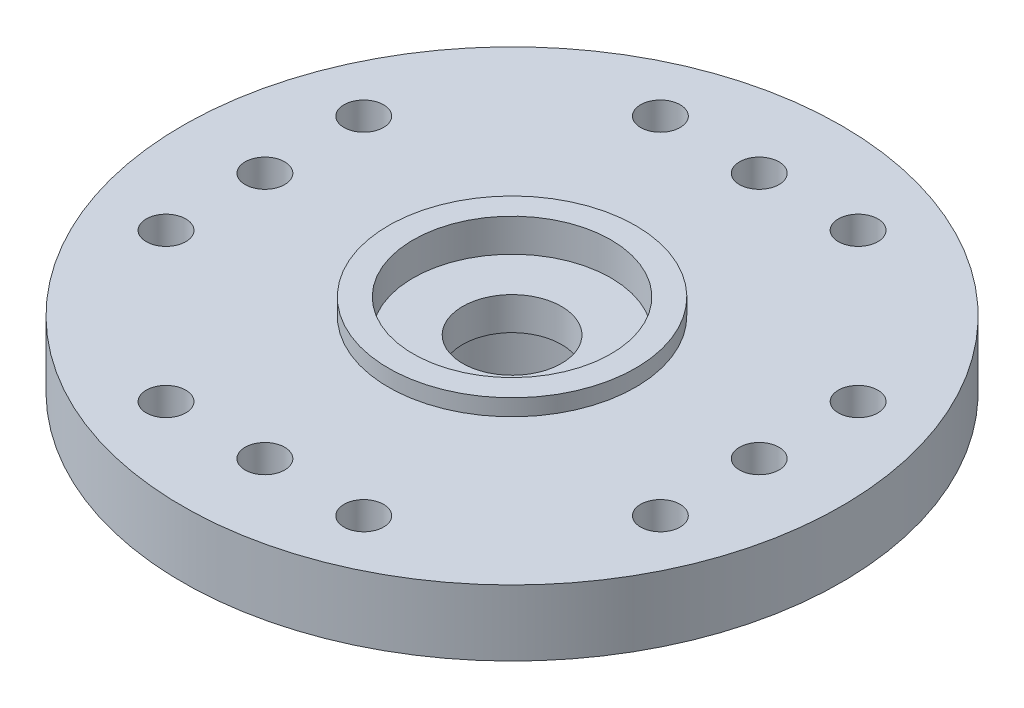
ISO-10303-21;
HEADER;
FILE_DESCRIPTION(('STEP AP214'),'2;1');
FILE_NAME('part.step','',(''),(''),'','','');
FILE_SCHEMA(('AUTOMOTIVE_DESIGN { 1 0 10303 214 1 1 1 1 }'));
ENDSEC;
DATA;
#1=APPLICATION_CONTEXT('core data for automotive mechanical design processes');
#2=APPLICATION_PROTOCOL_DEFINITION('international standard','automotive_design',2000,#1);
#3=PRODUCT_CONTEXT('',#1,'mechanical');
#4=PRODUCT('Part','Part','',(#3));
#5=PRODUCT_RELATED_PRODUCT_CATEGORY('part','',(#4));
#6=PRODUCT_DEFINITION_FORMATION('','',#4);
#7=PRODUCT_DEFINITION_CONTEXT('part definition',#1,'design');
#8=PRODUCT_DEFINITION('design','',#6,#7);
#9=PRODUCT_DEFINITION_SHAPE('','',#8);
#10=(LENGTH_UNIT() NAMED_UNIT(*) SI_UNIT(.MILLI.,.METRE.));
#11=(NAMED_UNIT(*) PLANE_ANGLE_UNIT() SI_UNIT($,.RADIAN.));
#12=(NAMED_UNIT(*) SI_UNIT($,.STERADIAN.) SOLID_ANGLE_UNIT());
#13=UNCERTAINTY_MEASURE_WITH_UNIT(LENGTH_MEASURE(1.E-05),#10,'distance_accuracy_value','');
#14=(GEOMETRIC_REPRESENTATION_CONTEXT(3) GLOBAL_UNCERTAINTY_ASSIGNED_CONTEXT((#13)) GLOBAL_UNIT_ASSIGNED_CONTEXT((#10,
#11,#12)) REPRESENTATION_CONTEXT('',''));
#15=CARTESIAN_POINT('',(0.,0.,0.));
#16=DIRECTION('',(0.,0.,1.));
#17=DIRECTION('',(1.,0.,0.));
#18=AXIS2_PLACEMENT_3D('',#15,#16,#17);
#19=CARTESIAN_POINT('',(4.5,0.,0.));
#20=DIRECTION('',(0.,-1.,0.));
#21=DIRECTION('',(0.,0.,-1.));
#22=AXIS2_PLACEMENT_3D('',#19,#20,#21);
#23=PLANE('',#22);
#24=CARTESIAN_POINT('',(0.,0.,0.));
#25=DIRECTION('',(0.,-1.,0.));
#26=DIRECTION('',(0.,0.,-1.));
#27=AXIS2_PLACEMENT_3D('',#24,#25,#26);
#28=CIRCLE('',#27,4.5);
#29=CARTESIAN_POINT('',(0.,0.,-4.5));
#30=VERTEX_POINT('',#29);
#31=EDGE_CURVE('E70',#30,#30,#28,.T.);
#32=ORIENTED_EDGE('',*,*,#31,.T.);
#33=EDGE_LOOP('',(#32));
#34=FACE_BOUND('',#33,.T.);
#35=CARTESIAN_POINT('',(0.,0.,0.));
#36=DIRECTION('',(0.,-1.,0.));
#37=DIRECTION('',(0.,0.,-1.));
#38=AXIS2_PLACEMENT_3D('',#35,#36,#37);
#39=CIRCLE('',#38,2.75);
#40=CARTESIAN_POINT('',(0.,0.,-2.75));
#41=VERTEX_POINT('',#40);
#42=EDGE_CURVE('E10',#41,#41,#39,.T.);
#43=ORIENTED_EDGE('',*,*,#42,.F.);
#44=EDGE_LOOP('',(#43));
#45=FACE_BOUND('',#44,.T.);
#46=ADVANCED_FACE('F30',(#34,#45),#23,.T.);
#47=CARTESIAN_POINT('',(0.,0.,0.));
#48=DIRECTION('',(0.,-1.,0.));
#49=DIRECTION('',(0.,0.,-1.));
#50=AXIS2_PLACEMENT_3D('',#47,#48,#49);
#51=CYLINDRICAL_SURFACE('',#50,2.75);
#52=ORIENTED_EDGE('',*,*,#42,.T.);
#53=EDGE_LOOP('',(#52));
#54=FACE_BOUND('',#53,.T.);
#55=CARTESIAN_POINT('',(0.,3.,0.));
#56=DIRECTION('',(0.,-1.,0.));
#57=DIRECTION('',(0.,0.,-1.));
#58=AXIS2_PLACEMENT_3D('',#55,#56,#57);
#59=CIRCLE('',#58,2.75);
#60=CARTESIAN_POINT('',(0.,3.,-2.75));
#61=VERTEX_POINT('',#60);
#62=EDGE_CURVE('E36',#61,#61,#59,.T.);
#63=ORIENTED_EDGE('',*,*,#62,.F.);
#64=EDGE_LOOP('',(#63));
#65=FACE_BOUND('',#64,.T.);
#66=ADVANCED_FACE('F193',(#54,#65),#51,.F.);
#67=CARTESIAN_POINT('',(2.75,3.,0.));
#68=DIRECTION('',(0.,-1.,0.));
#69=DIRECTION('',(0.,0.,-1.));
#70=AXIS2_PLACEMENT_3D('',#67,#68,#69);
#71=PLANE('',#70);
#72=ORIENTED_EDGE('',*,*,#62,.T.);
#73=EDGE_LOOP('',(#72));
#74=FACE_BOUND('',#73,.T.);
#75=CARTESIAN_POINT('',(0.,3.,0.));
#76=DIRECTION('',(0.,-1.,0.));
#77=DIRECTION('',(0.,0.,-1.));
#78=AXIS2_PLACEMENT_3D('',#75,#76,#77);
#79=CIRCLE('',#78,1.5);
#80=CARTESIAN_POINT('',(0.,3.,-1.5));
#81=VERTEX_POINT('',#80);
#82=EDGE_CURVE('E40',#81,#81,#79,.T.);
#83=ORIENTED_EDGE('',*,*,#82,.F.);
#84=EDGE_LOOP('',(#83));
#85=FACE_BOUND('',#84,.T.);
#86=ADVANCED_FACE('F197',(#74,#85),#71,.T.);
#87=CARTESIAN_POINT('',(0.,0.,0.));
#88=DIRECTION('',(0.,-1.,0.));
#89=DIRECTION('',(0.,0.,-1.));
#90=AXIS2_PLACEMENT_3D('',#87,#88,#89);
#91=CYLINDRICAL_SURFACE('',#90,1.5);
#92=ORIENTED_EDGE('',*,*,#82,.T.);
#93=EDGE_LOOP('',(#92));
#94=FACE_BOUND('',#93,.T.);
#95=CARTESIAN_POINT('',(0.,4.,0.));
#96=DIRECTION('',(0.,-1.,0.));
#97=DIRECTION('',(0.,0.,-1.));
#98=AXIS2_PLACEMENT_3D('',#95,#96,#97);
#99=CIRCLE('',#98,1.5);
#100=CARTESIAN_POINT('',(0.,4.,-1.5));
#101=VERTEX_POINT('',#100);
#102=EDGE_CURVE('E44',#101,#101,#99,.T.);
#103=ORIENTED_EDGE('',*,*,#102,.F.);
#104=EDGE_LOOP('',(#103));
#105=FACE_BOUND('',#104,.T.);
#106=ADVANCED_FACE('F201',(#94,#105),#91,.F.);
#107=CARTESIAN_POINT('',(1.5,4.,0.));
#108=DIRECTION('',(0.,1.,0.));
#109=DIRECTION('',(0.,0.,1.));
#110=AXIS2_PLACEMENT_3D('',#107,#108,#109);
#111=PLANE('',#110);
#112=ORIENTED_EDGE('',*,*,#102,.T.);
#113=EDGE_LOOP('',(#112));
#114=FACE_BOUND('',#113,.T.);
#115=CARTESIAN_POINT('',(0.,4.,0.));
#116=DIRECTION('',(0.,-1.,0.));
#117=DIRECTION('',(0.,0.,-1.));
#118=AXIS2_PLACEMENT_3D('',#115,#116,#117);
#119=CIRCLE('',#118,3.);
#120=CARTESIAN_POINT('',(0.,4.,-3.));
#121=VERTEX_POINT('',#120);
#122=EDGE_CURVE('E49',#121,#121,#119,.T.);
#123=ORIENTED_EDGE('',*,*,#122,.F.);
#124=EDGE_LOOP('',(#123));
#125=FACE_BOUND('',#124,.T.);
#126=ADVANCED_FACE('F207',(#114,#125),#111,.T.);
#127=CARTESIAN_POINT('',(0.,0.,0.));
#128=DIRECTION('',(0.,-1.,0.));
#129=DIRECTION('',(0.,0.,-1.));
#130=AXIS2_PLACEMENT_3D('',#127,#128,#129);
#131=CYLINDRICAL_SURFACE('',#130,3.);
#132=ORIENTED_EDGE('',*,*,#122,.T.);
#133=EDGE_LOOP('',(#132));
#134=FACE_BOUND('',#133,.T.);
#135=CARTESIAN_POINT('',(0.,5.,0.));
#136=DIRECTION('',(0.,-1.,0.));
#137=DIRECTION('',(0.,0.,-1.));
#138=AXIS2_PLACEMENT_3D('',#135,#136,#137);
#139=CIRCLE('',#138,3.);
#140=CARTESIAN_POINT('',(0.,5.,-3.));
#141=VERTEX_POINT('',#140);
#142=EDGE_CURVE('E52',#141,#141,#139,.T.);
#143=ORIENTED_EDGE('',*,*,#142,.F.);
#144=EDGE_LOOP('',(#143));
#145=FACE_BOUND('',#144,.T.);
#146=ADVANCED_FACE('F211',(#134,#145),#131,.F.);
#147=CARTESIAN_POINT('',(3.,5.,0.));
#148=DIRECTION('',(0.,1.,0.));
#149=DIRECTION('',(0.,0.,1.));
#150=AXIS2_PLACEMENT_3D('',#147,#148,#149);
#151=PLANE('',#150);
#152=ORIENTED_EDGE('',*,*,#142,.T.);
#153=EDGE_LOOP('',(#152));
#154=FACE_BOUND('',#153,.T.);
#155=CARTESIAN_POINT('',(0.,5.,0.));
#156=DIRECTION('',(0.,-1.,0.));
#157=DIRECTION('',(0.,0.,-1.));
#158=AXIS2_PLACEMENT_3D('',#155,#156,#157);
#159=CIRCLE('',#158,3.75);
#160=CARTESIAN_POINT('',(0.,5.,-3.75));
#161=VERTEX_POINT('',#160);
#162=EDGE_CURVE('E55',#161,#161,#159,.T.);
#163=ORIENTED_EDGE('',*,*,#162,.F.);
#164=EDGE_LOOP('',(#163));
#165=FACE_BOUND('',#164,.T.);
#166=ADVANCED_FACE('F215',(#154,#165),#151,.T.);
#167=CARTESIAN_POINT('',(0.,0.,0.));
#168=DIRECTION('',(0.,-1.,0.));
#169=DIRECTION('',(0.,0.,-1.));
#170=AXIS2_PLACEMENT_3D('',#167,#168,#169);
#171=CYLINDRICAL_SURFACE('',#170,3.75);
#172=ORIENTED_EDGE('',*,*,#162,.T.);
#173=EDGE_LOOP('',(#172));
#174=FACE_BOUND('',#173,.T.);
#175=CARTESIAN_POINT('',(0.,4.5,0.));
#176=DIRECTION('',(0.,-1.,0.));
#177=DIRECTION('',(0.,0.,-1.));
#178=AXIS2_PLACEMENT_3D('',#175,#176,#177);
#179=CIRCLE('',#178,3.75);
#180=CARTESIAN_POINT('',(0.,4.5,-3.75));
#181=VERTEX_POINT('',#180);
#182=EDGE_CURVE('E58',#181,#181,#179,.T.);
#183=ORIENTED_EDGE('',*,*,#182,.F.);
#184=EDGE_LOOP('',(#183));
#185=FACE_BOUND('',#184,.T.);
#186=ADVANCED_FACE('F153',(#174,#185),#171,.T.);
#187=CARTESIAN_POINT('',(3.75,4.5,0.));
#188=DIRECTION('',(0.,1.,0.));
#189=DIRECTION('',(0.,0.,1.));
#190=AXIS2_PLACEMENT_3D('',#187,#188,#189);
#191=PLANE('',#190);
#192=CARTESIAN_POINT('',(7.49999999999999,4.5,3.00000000000003));
#193=DIRECTION('',(0.,1.,0.));
#194=DIRECTION('',(-1.,0.,0.));
#195=AXIS2_PLACEMENT_3D('',#192,#193,#194);
#196=CIRCLE('',#195,0.6);
#197=CARTESIAN_POINT('',(6.89999999999999,4.5,3.00000000000002));
#198=VERTEX_POINT('',#197);
#199=EDGE_CURVE('E115',#198,#198,#196,.T.);
#200=ORIENTED_EDGE('',*,*,#199,.F.);
#201=EDGE_LOOP('',(#200));
#202=FACE_BOUND('',#201,.T.);
#203=CARTESIAN_POINT('',(7.50000000000001,4.5,-2.99999999999997));
#204=DIRECTION('',(0.,1.,0.));
#205=DIRECTION('',(1.,0.,0.));
#206=AXIS2_PLACEMENT_3D('',#203,#204,#205);
#207=CIRCLE('',#206,0.6);
#208=CARTESIAN_POINT('',(8.10000000000001,4.5,-2.99999999999997));
#209=VERTEX_POINT('',#208);
#210=EDGE_CURVE('E109',#209,#209,#207,.T.);
#211=ORIENTED_EDGE('',*,*,#210,.F.);
#212=EDGE_LOOP('',(#211));
#213=FACE_BOUND('',#212,.T.);
#214=CARTESIAN_POINT('',(0.,4.5,7.5));
#215=DIRECTION('',(0.,1.,0.));
#216=DIRECTION('',(0.,0.,-1.));
#217=AXIS2_PLACEMENT_3D('',#214,#215,#216);
#218=CIRCLE('',#217,0.6);
#219=CARTESIAN_POINT('',(0.,4.5,6.9));
#220=VERTEX_POINT('',#219);
#221=EDGE_CURVE('E101',#220,#220,#218,.T.);
#222=ORIENTED_EDGE('',*,*,#221,.F.);
#223=EDGE_LOOP('',(#222));
#224=FACE_BOUND('',#223,.T.);
#225=CARTESIAN_POINT('',(-3.,4.5,7.5));
#226=DIRECTION('',(0.,1.,0.));
#227=DIRECTION('',(0.,0.,-1.));
#228=AXIS2_PLACEMENT_3D('',#225,#226,#227);
#229=CIRCLE('',#228,0.6);
#230=CARTESIAN_POINT('',(-3.,4.5,6.9));
#231=VERTEX_POINT('',#230);
#232=EDGE_CURVE('E102',#231,#231,#229,.T.);
#233=ORIENTED_EDGE('',*,*,#232,.F.);
#234=EDGE_LOOP('',(#233));
#235=FACE_BOUND('',#234,.T.);
#236=CARTESIAN_POINT('',(-7.50000000000003,4.5,2.99999999999992));
#237=DIRECTION('',(0.,1.,0.));
#238=DIRECTION('',(-1.,0.,0.));
#239=AXIS2_PLACEMENT_3D('',#236,#237,#238);
#240=CIRCLE('',#239,0.6);
#241=CARTESIAN_POINT('',(-8.10000000000003,4.5,2.99999999999992));
#242=VERTEX_POINT('',#241);
#243=EDGE_CURVE('E138',#242,#242,#240,.T.);
#244=ORIENTED_EDGE('',*,*,#243,.F.);
#245=EDGE_LOOP('',(#244));
#246=FACE_BOUND('',#245,.T.);
#247=CARTESIAN_POINT('',(-7.49999999999997,4.5,-3.00000000000008));
#248=DIRECTION('',(0.,1.,0.));
#249=DIRECTION('',(1.,0.,0.));
#250=AXIS2_PLACEMENT_3D('',#247,#248,#249);
#251=CIRCLE('',#250,0.6);
#252=CARTESIAN_POINT('',(-6.89999999999997,4.5,-3.00000000000007));
#253=VERTEX_POINT('',#252);
#254=EDGE_CURVE('E137',#253,#253,#251,.T.);
#255=ORIENTED_EDGE('',*,*,#254,.F.);
#256=EDGE_LOOP('',(#255));
#257=FACE_BOUND('',#256,.T.);
#258=CARTESIAN_POINT('',(-7.5,4.5,0.));
#259=DIRECTION('',(0.,1.,0.));
#260=DIRECTION('',(1.,0.,0.));
#261=AXIS2_PLACEMENT_3D('',#258,#259,#260);
#262=CIRCLE('',#261,0.6);
#263=CARTESIAN_POINT('',(-6.9,4.5,0.));
#264=VERTEX_POINT('',#263);
#265=EDGE_CURVE('E126',#264,#264,#262,.T.);
#266=ORIENTED_EDGE('',*,*,#265,.F.);
#267=EDGE_LOOP('',(#266));
#268=FACE_BOUND('',#267,.T.);
#269=CARTESIAN_POINT('',(3.,4.5,7.5));
#270=DIRECTION('',(0.,1.,0.));
#271=DIRECTION('',(0.,0.,1.));
#272=AXIS2_PLACEMENT_3D('',#269,#270,#271);
#273=CIRCLE('',#272,0.6);
#274=CARTESIAN_POINT('',(3.,4.5,8.1));
#275=VERTEX_POINT('',#274);
#276=EDGE_CURVE('E125',#275,#275,#273,.T.);
#277=ORIENTED_EDGE('',*,*,#276,.F.);
#278=EDGE_LOOP('',(#277));
#279=FACE_BOUND('',#278,.T.);
#280=CARTESIAN_POINT('',(7.5,4.5,0.));
#281=DIRECTION('',(0.,1.,0.));
#282=DIRECTION('',(-1.,0.,0.));
#283=AXIS2_PLACEMENT_3D('',#280,#281,#282);
#284=CIRCLE('',#283,0.6);
#285=CARTESIAN_POINT('',(6.9,4.5,0.));
#286=VERTEX_POINT('',#285);
#287=EDGE_CURVE('E94',#286,#286,#284,.T.);
#288=ORIENTED_EDGE('',*,*,#287,.F.);
#289=EDGE_LOOP('',(#288));
#290=FACE_BOUND('',#289,.T.);
#291=CARTESIAN_POINT('',(-3.,4.5,-7.5));
#292=DIRECTION('',(0.,1.,0.));
#293=DIRECTION('',(0.,0.,-1.));
#294=AXIS2_PLACEMENT_3D('',#291,#292,#293);
#295=CIRCLE('',#294,0.6);
#296=CARTESIAN_POINT('',(-3.,4.5,-8.1));
#297=VERTEX_POINT('',#296);
#298=EDGE_CURVE('E84',#297,#297,#295,.T.);
#299=ORIENTED_EDGE('',*,*,#298,.F.);
#300=EDGE_LOOP('',(#299));
#301=FACE_BOUND('',#300,.T.);
#302=CARTESIAN_POINT('',(3.,4.5,-7.5));
#303=DIRECTION('',(0.,1.,0.));
#304=DIRECTION('',(0.,0.,1.));
#305=AXIS2_PLACEMENT_3D('',#302,#303,#304);
#306=CIRCLE('',#305,0.6);
#307=CARTESIAN_POINT('',(3.,4.5,-6.9));
#308=VERTEX_POINT('',#307);
#309=EDGE_CURVE('E83',#308,#308,#306,.T.);
#310=ORIENTED_EDGE('',*,*,#309,.F.);
#311=EDGE_LOOP('',(#310));
#312=FACE_BOUND('',#311,.T.);
#313=CARTESIAN_POINT('',(0.,4.5,-7.5));
#314=DIRECTION('',(0.,1.,0.));
#315=DIRECTION('',(0.,0.,1.));
#316=AXIS2_PLACEMENT_3D('',#313,#314,#315);
#317=CIRCLE('',#316,0.6);
#318=CARTESIAN_POINT('',(0.,4.5,-6.9));
#319=VERTEX_POINT('',#318);
#320=EDGE_CURVE('E76',#319,#319,#317,.T.);
#321=ORIENTED_EDGE('',*,*,#320,.F.);
#322=EDGE_LOOP('',(#321));
#323=FACE_BOUND('',#322,.T.);
#324=ORIENTED_EDGE('',*,*,#182,.T.);
#325=EDGE_LOOP('',(#324));
#326=FACE_BOUND('',#325,.T.);
#327=CARTESIAN_POINT('',(0.,4.5,0.));
#328=DIRECTION('',(0.,-1.,0.));
#329=DIRECTION('',(0.,0.,-1.));
#330=AXIS2_PLACEMENT_3D('',#327,#328,#329);
#331=CIRCLE('',#330,10.);
#332=CARTESIAN_POINT('',(0.,4.5,-10.));
#333=VERTEX_POINT('',#332);
#334=EDGE_CURVE('E61',#333,#333,#331,.T.);
#335=ORIENTED_EDGE('',*,*,#334,.F.);
#336=EDGE_LOOP('',(#335));
#337=FACE_BOUND('',#336,.T.);
#338=ADVANCED_FACE('F149',(#202,#213,#224,#235,#246,#257,#268,#279,#290,#301,#312,#323,#326,
#337),#191,.T.);
#339=CARTESIAN_POINT('',(0.,0.,0.));
#340=DIRECTION('',(0.,-1.,0.));
#341=DIRECTION('',(0.,0.,-1.));
#342=AXIS2_PLACEMENT_3D('',#339,#340,#341);
#343=CYLINDRICAL_SURFACE('',#342,10.);
#344=ORIENTED_EDGE('',*,*,#334,.T.);
#345=EDGE_LOOP('',(#344));
#346=FACE_BOUND('',#345,.T.);
#347=CARTESIAN_POINT('',(0.,2.5,0.));
#348=DIRECTION('',(0.,-1.,0.));
#349=DIRECTION('',(0.,0.,-1.));
#350=AXIS2_PLACEMENT_3D('',#347,#348,#349);
#351=CIRCLE('',#350,10.);
#352=CARTESIAN_POINT('',(0.,2.5,-10.));
#353=VERTEX_POINT('',#352);
#354=EDGE_CURVE('E64',#353,#353,#351,.T.);
#355=ORIENTED_EDGE('',*,*,#354,.F.);
#356=EDGE_LOOP('',(#355));
#357=FACE_BOUND('',#356,.T.);
#358=ADVANCED_FACE('F152',(#346,#357),#343,.T.);
#359=CARTESIAN_POINT('',(10.,2.5,0.));
#360=DIRECTION('',(0.,-1.,0.));
#361=DIRECTION('',(0.,0.,-1.));
#362=AXIS2_PLACEMENT_3D('',#359,#360,#361);
#363=PLANE('',#362);
#364=CARTESIAN_POINT('',(7.49999999999999,2.5,3.00000000000003));
#365=DIRECTION('',(0.,-1.,0.));
#366=DIRECTION('',(0.,0.,-1.));
#367=AXIS2_PLACEMENT_3D('',#364,#365,#366);
#368=CIRCLE('',#367,0.6);
#369=CARTESIAN_POINT('',(7.49999999999999,2.5,2.40000000000003));
#370=VERTEX_POINT('',#369);
#371=EDGE_CURVE('E97',#370,#370,#368,.F.);
#372=ORIENTED_EDGE('',*,*,#371,.T.);
#373=EDGE_LOOP('',(#372));
#374=FACE_BOUND('',#373,.T.);
#375=CARTESIAN_POINT('',(7.50000000000001,2.5,-2.99999999999997));
#376=DIRECTION('',(0.,-1.,0.));
#377=DIRECTION('',(0.,0.,-1.));
#378=AXIS2_PLACEMENT_3D('',#375,#376,#377);
#379=CIRCLE('',#378,0.6);
#380=CARTESIAN_POINT('',(7.50000000000001,2.5,-3.59999999999997));
#381=VERTEX_POINT('',#380);
#382=EDGE_CURVE('E112',#381,#381,#379,.F.);
#383=ORIENTED_EDGE('',*,*,#382,.T.);
#384=EDGE_LOOP('',(#383));
#385=FACE_BOUND('',#384,.T.);
#386=CARTESIAN_POINT('',(0.,2.5,7.5));
#387=DIRECTION('',(0.,-1.,0.));
#388=DIRECTION('',(0.,0.,-1.));
#389=AXIS2_PLACEMENT_3D('',#386,#387,#388);
#390=CIRCLE('',#389,0.6);
#391=CARTESIAN_POINT('',(0.,2.5,6.9));
#392=VERTEX_POINT('',#391);
#393=EDGE_CURVE('E106',#392,#392,#390,.F.);
#394=ORIENTED_EDGE('',*,*,#393,.T.);
#395=EDGE_LOOP('',(#394));
#396=FACE_BOUND('',#395,.T.);
#397=CARTESIAN_POINT('',(-3.,2.5,7.5));
#398=DIRECTION('',(0.,-1.,0.));
#399=DIRECTION('',(0.,0.,-1.));
#400=AXIS2_PLACEMENT_3D('',#397,#398,#399);
#401=CIRCLE('',#400,0.6);
#402=CARTESIAN_POINT('',(-3.,2.5,6.9));
#403=VERTEX_POINT('',#402);
#404=EDGE_CURVE('E98',#403,#403,#401,.F.);
#405=ORIENTED_EDGE('',*,*,#404,.T.);
#406=EDGE_LOOP('',(#405));
#407=FACE_BOUND('',#406,.T.);
#408=CARTESIAN_POINT('',(-7.50000000000003,2.5,2.99999999999992));
#409=DIRECTION('',(0.,-1.,0.));
#410=DIRECTION('',(0.,0.,-1.));
#411=AXIS2_PLACEMENT_3D('',#408,#409,#410);
#412=CIRCLE('',#411,0.6);
#413=CARTESIAN_POINT('',(-7.50000000000003,2.5,2.39999999999992));
#414=VERTEX_POINT('',#413);
#415=EDGE_CURVE('E134',#414,#414,#412,.F.);
#416=ORIENTED_EDGE('',*,*,#415,.T.);
#417=EDGE_LOOP('',(#416));
#418=FACE_BOUND('',#417,.T.);
#419=CARTESIAN_POINT('',(-7.49999999999997,2.5,-3.00000000000008));
#420=DIRECTION('',(0.,-1.,0.));
#421=DIRECTION('',(0.,0.,-1.));
#422=AXIS2_PLACEMENT_3D('',#419,#420,#421);
#423=CIRCLE('',#422,0.6);
#424=CARTESIAN_POINT('',(-7.49999999999997,2.5,-3.60000000000008));
#425=VERTEX_POINT('',#424);
#426=EDGE_CURVE('E129',#425,#425,#423,.F.);
#427=ORIENTED_EDGE('',*,*,#426,.T.);
#428=EDGE_LOOP('',(#427));
#429=FACE_BOUND('',#428,.T.);
#430=CARTESIAN_POINT('',(-7.5,2.5,0.));
#431=DIRECTION('',(0.,-1.,0.));
#432=DIRECTION('',(0.,0.,-1.));
#433=AXIS2_PLACEMENT_3D('',#430,#431,#432);
#434=CIRCLE('',#433,0.6);
#435=CARTESIAN_POINT('',(-7.5,2.5,-0.600000000000079));
#436=VERTEX_POINT('',#435);
#437=EDGE_CURVE('E122',#436,#436,#434,.F.);
#438=ORIENTED_EDGE('',*,*,#437,.T.);
#439=EDGE_LOOP('',(#438));
#440=FACE_BOUND('',#439,.T.);
#441=CARTESIAN_POINT('',(3.,2.5,7.5));
#442=DIRECTION('',(0.,-1.,0.));
#443=DIRECTION('',(0.,0.,-1.));
#444=AXIS2_PLACEMENT_3D('',#441,#442,#443);
#445=CIRCLE('',#444,0.6);
#446=CARTESIAN_POINT('',(3.,2.5,6.9));
#447=VERTEX_POINT('',#446);
#448=EDGE_CURVE('E105',#447,#447,#445,.F.);
#449=ORIENTED_EDGE('',*,*,#448,.T.);
#450=EDGE_LOOP('',(#449));
#451=FACE_BOUND('',#450,.T.);
#452=CARTESIAN_POINT('',(7.5,2.5,0.));
#453=DIRECTION('',(0.,-1.,0.));
#454=DIRECTION('',(0.,0.,-1.));
#455=AXIS2_PLACEMENT_3D('',#452,#453,#454);
#456=CIRCLE('',#455,0.6);
#457=CARTESIAN_POINT('',(7.5,2.5,-0.599999999999973));
#458=VERTEX_POINT('',#457);
#459=EDGE_CURVE('E87',#458,#458,#456,.F.);
#460=ORIENTED_EDGE('',*,*,#459,.T.);
#461=EDGE_LOOP('',(#460));
#462=FACE_BOUND('',#461,.T.);
#463=CARTESIAN_POINT('',(-3.,2.5,-7.5));
#464=DIRECTION('',(0.,-1.,0.));
#465=DIRECTION('',(0.,0.,-1.));
#466=AXIS2_PLACEMENT_3D('',#463,#464,#465);
#467=CIRCLE('',#466,0.6);
#468=CARTESIAN_POINT('',(-3.,2.5,-8.1));
#469=VERTEX_POINT('',#468);
#470=EDGE_CURVE('E80',#469,#469,#467,.F.);
#471=ORIENTED_EDGE('',*,*,#470,.T.);
#472=EDGE_LOOP('',(#471));
#473=FACE_BOUND('',#472,.T.);
#474=CARTESIAN_POINT('',(3.,2.5,-7.5));
#475=DIRECTION('',(0.,-1.,0.));
#476=DIRECTION('',(0.,0.,-1.));
#477=AXIS2_PLACEMENT_3D('',#474,#475,#476);
#478=CIRCLE('',#477,0.6);
#479=CARTESIAN_POINT('',(3.,2.5,-8.1));
#480=VERTEX_POINT('',#479);
#481=EDGE_CURVE('E79',#480,#480,#478,.F.);
#482=ORIENTED_EDGE('',*,*,#481,.T.);
#483=EDGE_LOOP('',(#482));
#484=FACE_BOUND('',#483,.T.);
#485=CARTESIAN_POINT('',(0.,2.5,-7.5));
#486=DIRECTION('',(0.,-1.,0.));
#487=DIRECTION('',(0.,0.,-1.));
#488=AXIS2_PLACEMENT_3D('',#485,#486,#487);
#489=CIRCLE('',#488,0.6);
#490=CARTESIAN_POINT('',(0.,2.5,-8.1));
#491=VERTEX_POINT('',#490);
#492=EDGE_CURVE('E73',#491,#491,#489,.F.);
#493=ORIENTED_EDGE('',*,*,#492,.T.);
#494=EDGE_LOOP('',(#493));
#495=FACE_BOUND('',#494,.T.);
#496=ORIENTED_EDGE('',*,*,#354,.T.);
#497=EDGE_LOOP('',(#496));
#498=FACE_BOUND('',#497,.T.);
#499=CARTESIAN_POINT('',(0.,2.5,0.));
#500=DIRECTION('',(0.,-1.,0.));
#501=DIRECTION('',(0.,0.,-1.));
#502=AXIS2_PLACEMENT_3D('',#499,#500,#501);
#503=CIRCLE('',#502,4.5);
#504=CARTESIAN_POINT('',(0.,2.5,-4.5));
#505=VERTEX_POINT('',#504);
#506=EDGE_CURVE('E67',#505,#505,#503,.T.);
#507=ORIENTED_EDGE('',*,*,#506,.F.);
#508=EDGE_LOOP('',(#507));
#509=FACE_BOUND('',#508,.T.);
#510=ADVANCED_FACE('F174',(#374,#385,#396,#407,#418,#429,#440,#451,#462,#473,#484,#495,#498,
#509),#363,.T.);
#511=CARTESIAN_POINT('',(0.,0.,0.));
#512=DIRECTION('',(0.,-1.,0.));
#513=DIRECTION('',(0.,0.,-1.));
#514=AXIS2_PLACEMENT_3D('',#511,#512,#513);
#515=CYLINDRICAL_SURFACE('',#514,4.5);
#516=ORIENTED_EDGE('',*,*,#506,.T.);
#517=EDGE_LOOP('',(#516));
#518=FACE_BOUND('',#517,.T.);
#519=ORIENTED_EDGE('',*,*,#31,.F.);
#520=EDGE_LOOP('',(#519));
#521=FACE_BOUND('',#520,.T.);
#522=ADVANCED_FACE('F180',(#518,#521),#515,.T.);
#523=CARTESIAN_POINT('',(0.,0.802943725152287,-7.5));
#524=DIRECTION('',(0.,1.,0.));
#525=DIRECTION('',(0.,0.,1.));
#526=AXIS2_PLACEMENT_3D('',#523,#524,#525);
#527=CYLINDRICAL_SURFACE('',#526,0.6);
#528=ORIENTED_EDGE('',*,*,#320,.T.);
#529=EDGE_LOOP('',(#528));
#530=FACE_BOUND('',#529,.T.);
#531=ORIENTED_EDGE('',*,*,#492,.F.);
#532=EDGE_LOOP('',(#531));
#533=FACE_BOUND('',#532,.T.);
#534=ADVANCED_FACE('F187',(#530,#533),#527,.F.);
#535=CARTESIAN_POINT('',(3.,0.802943725152287,-7.5));
#536=DIRECTION('',(0.,1.,0.));
#537=DIRECTION('',(0.,0.,1.));
#538=AXIS2_PLACEMENT_3D('',#535,#536,#537);
#539=CYLINDRICAL_SURFACE('',#538,0.6);
#540=ORIENTED_EDGE('',*,*,#309,.T.);
#541=EDGE_LOOP('',(#540));
#542=FACE_BOUND('',#541,.T.);
#543=ORIENTED_EDGE('',*,*,#481,.F.);
#544=EDGE_LOOP('',(#543));
#545=FACE_BOUND('',#544,.T.);
#546=ADVANCED_FACE('F225',(#542,#545),#539,.F.);
#547=CARTESIAN_POINT('',(-3.,0.802943725152287,-7.5));
#548=DIRECTION('',(0.,1.,0.));
#549=DIRECTION('',(0.,0.,1.));
#550=AXIS2_PLACEMENT_3D('',#547,#548,#549);
#551=CYLINDRICAL_SURFACE('',#550,0.6);
#552=ORIENTED_EDGE('',*,*,#298,.T.);
#553=EDGE_LOOP('',(#552));
#554=FACE_BOUND('',#553,.T.);
#555=ORIENTED_EDGE('',*,*,#470,.F.);
#556=EDGE_LOOP('',(#555));
#557=FACE_BOUND('',#556,.T.);
#558=ADVANCED_FACE('F227',(#554,#557),#551,.F.);
#559=CARTESIAN_POINT('',(7.5,0.802943725152287,0.));
#560=DIRECTION('',(0.,1.,0.));
#561=DIRECTION('',(0.,0.,1.));
#562=AXIS2_PLACEMENT_3D('',#559,#560,#561);
#563=CYLINDRICAL_SURFACE('',#562,0.6);
#564=ORIENTED_EDGE('',*,*,#287,.T.);
#565=EDGE_LOOP('',(#564));
#566=FACE_BOUND('',#565,.T.);
#567=ORIENTED_EDGE('',*,*,#459,.F.);
#568=EDGE_LOOP('',(#567));
#569=FACE_BOUND('',#568,.T.);
#570=ADVANCED_FACE('F230',(#566,#569),#563,.F.);
#571=CARTESIAN_POINT('',(3.,0.802943725152287,7.5));
#572=DIRECTION('',(0.,1.,0.));
#573=DIRECTION('',(0.,0.,1.));
#574=AXIS2_PLACEMENT_3D('',#571,#572,#573);
#575=CYLINDRICAL_SURFACE('',#574,0.6);
#576=ORIENTED_EDGE('',*,*,#276,.T.);
#577=EDGE_LOOP('',(#576));
#578=FACE_BOUND('',#577,.T.);
#579=ORIENTED_EDGE('',*,*,#448,.F.);
#580=EDGE_LOOP('',(#579));
#581=FACE_BOUND('',#580,.T.);
#582=ADVANCED_FACE('F237',(#578,#581),#575,.F.);
#583=CARTESIAN_POINT('',(-7.5,0.802943725152287,0.));
#584=DIRECTION('',(0.,1.,0.));
#585=DIRECTION('',(0.,0.,1.));
#586=AXIS2_PLACEMENT_3D('',#583,#584,#585);
#587=CYLINDRICAL_SURFACE('',#586,0.6);
#588=ORIENTED_EDGE('',*,*,#265,.T.);
#589=EDGE_LOOP('',(#588));
#590=FACE_BOUND('',#589,.T.);
#591=ORIENTED_EDGE('',*,*,#437,.F.);
#592=EDGE_LOOP('',(#591));
#593=FACE_BOUND('',#592,.T.);
#594=ADVANCED_FACE('F256',(#590,#593),#587,.F.);
#595=CARTESIAN_POINT('',(-7.49999999999997,0.802943725152287,-3.00000000000008));
#596=DIRECTION('',(0.,1.,0.));
#597=DIRECTION('',(0.,0.,1.));
#598=AXIS2_PLACEMENT_3D('',#595,#596,#597);
#599=CYLINDRICAL_SURFACE('',#598,0.6);
#600=ORIENTED_EDGE('',*,*,#254,.T.);
#601=EDGE_LOOP('',(#600));
#602=FACE_BOUND('',#601,.T.);
#603=ORIENTED_EDGE('',*,*,#426,.F.);
#604=EDGE_LOOP('',(#603));
#605=FACE_BOUND('',#604,.T.);
#606=ADVANCED_FACE('F146',(#602,#605),#599,.F.);
#607=CARTESIAN_POINT('',(-7.50000000000003,0.802943725152287,2.99999999999992));
#608=DIRECTION('',(0.,1.,0.));
#609=DIRECTION('',(0.,0.,1.));
#610=AXIS2_PLACEMENT_3D('',#607,#608,#609);
#611=CYLINDRICAL_SURFACE('',#610,0.6);
#612=ORIENTED_EDGE('',*,*,#243,.T.);
#613=EDGE_LOOP('',(#612));
#614=FACE_BOUND('',#613,.T.);
#615=ORIENTED_EDGE('',*,*,#415,.F.);
#616=EDGE_LOOP('',(#615));
#617=FACE_BOUND('',#616,.T.);
#618=ADVANCED_FACE('F243',(#614,#617),#611,.F.);
#619=CARTESIAN_POINT('',(-3.,0.802943725152287,7.5));
#620=DIRECTION('',(0.,1.,0.));
#621=DIRECTION('',(0.,0.,1.));
#622=AXIS2_PLACEMENT_3D('',#619,#620,#621);
#623=CYLINDRICAL_SURFACE('',#622,0.6);
#624=ORIENTED_EDGE('',*,*,#232,.T.);
#625=EDGE_LOOP('',(#624));
#626=FACE_BOUND('',#625,.T.);
#627=ORIENTED_EDGE('',*,*,#404,.F.);
#628=EDGE_LOOP('',(#627));
#629=FACE_BOUND('',#628,.T.);
#630=ADVANCED_FACE('F239',(#626,#629),#623,.F.);
#631=CARTESIAN_POINT('',(0.,0.802943725152287,7.5));
#632=DIRECTION('',(0.,1.,0.));
#633=DIRECTION('',(0.,0.,1.));
#634=AXIS2_PLACEMENT_3D('',#631,#632,#633);
#635=CYLINDRICAL_SURFACE('',#634,0.6);
#636=ORIENTED_EDGE('',*,*,#221,.T.);
#637=EDGE_LOOP('',(#636));
#638=FACE_BOUND('',#637,.T.);
#639=ORIENTED_EDGE('',*,*,#393,.F.);
#640=EDGE_LOOP('',(#639));
#641=FACE_BOUND('',#640,.T.);
#642=ADVANCED_FACE('F242',(#638,#641),#635,.F.);
#643=CARTESIAN_POINT('',(7.50000000000001,0.802943725152287,-2.99999999999997));
#644=DIRECTION('',(0.,1.,0.));
#645=DIRECTION('',(0.,0.,1.));
#646=AXIS2_PLACEMENT_3D('',#643,#644,#645);
#647=CYLINDRICAL_SURFACE('',#646,0.6);
#648=ORIENTED_EDGE('',*,*,#210,.T.);
#649=EDGE_LOOP('',(#648));
#650=FACE_BOUND('',#649,.T.);
#651=ORIENTED_EDGE('',*,*,#382,.F.);
#652=EDGE_LOOP('',(#651));
#653=FACE_BOUND('',#652,.T.);
#654=ADVANCED_FACE('F247',(#650,#653),#647,.F.);
#655=CARTESIAN_POINT('',(7.49999999999999,0.802943725152287,3.00000000000003));
#656=DIRECTION('',(0.,1.,0.));
#657=DIRECTION('',(0.,0.,1.));
#658=AXIS2_PLACEMENT_3D('',#655,#656,#657);
#659=CYLINDRICAL_SURFACE('',#658,0.6);
#660=ORIENTED_EDGE('',*,*,#199,.T.);
#661=EDGE_LOOP('',(#660));
#662=FACE_BOUND('',#661,.T.);
#663=ORIENTED_EDGE('',*,*,#371,.F.);
#664=EDGE_LOOP('',(#663));
#665=FACE_BOUND('',#664,.T.);
#666=ADVANCED_FACE('F251',(#662,#665),#659,.F.);
#667=CLOSED_SHELL('',(#46,#66,#86,#106,#126,#146,#166,#186,#338,#358,#510,#522,#534,#546,#558,
#570,#582,#594,#606,#618,#630,#642,#654,#666));
#668=MANIFOLD_SOLID_BREP('B2',#667);
#669=ADVANCED_BREP_SHAPE_REPRESENTATION('',(#18,#668),#14);
#670=SHAPE_DEFINITION_REPRESENTATION(#9,#669);
ENDSEC;
END-ISO-10303-21;
